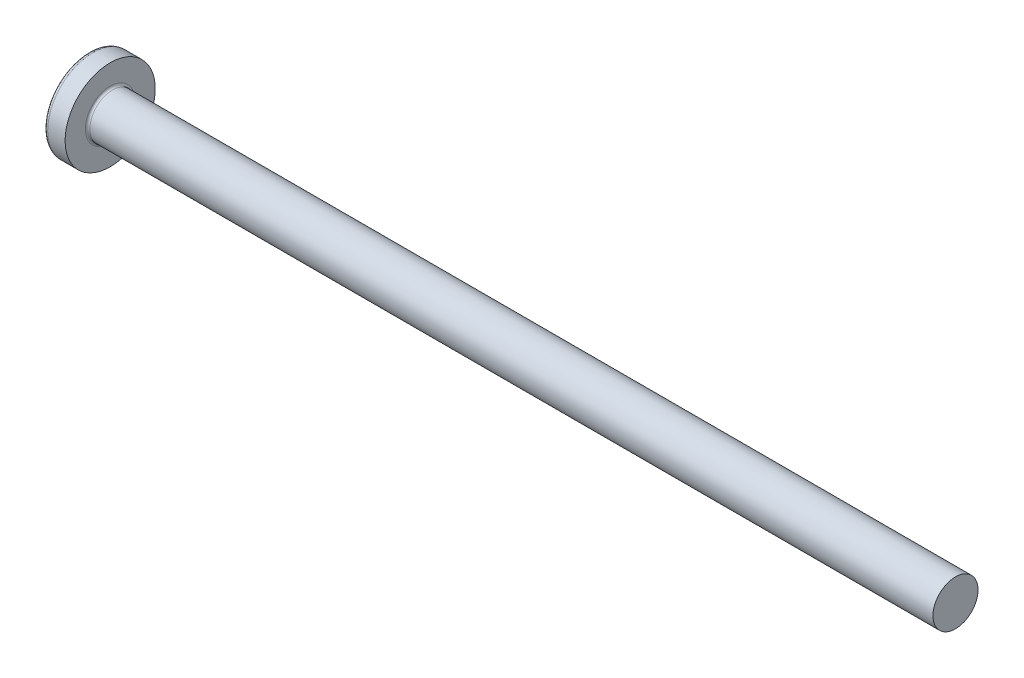
ISO-10303-21;
HEADER;
FILE_DESCRIPTION(('STEP AP214'),'2;1');
FILE_NAME('part.step','',(''),(''),'','','');
FILE_SCHEMA(('AUTOMOTIVE_DESIGN { 1 0 10303 214 1 1 1 1 }'));
ENDSEC;
DATA;
#1=APPLICATION_CONTEXT('core data for automotive mechanical design processes');
#2=APPLICATION_PROTOCOL_DEFINITION('international standard','automotive_design',2000,#1);
#3=PRODUCT_CONTEXT('',#1,'mechanical');
#4=PRODUCT('Part','Part','',(#3));
#5=PRODUCT_RELATED_PRODUCT_CATEGORY('part','',(#4));
#6=PRODUCT_DEFINITION_FORMATION('','',#4);
#7=PRODUCT_DEFINITION_CONTEXT('part definition',#1,'design');
#8=PRODUCT_DEFINITION('design','',#6,#7);
#9=PRODUCT_DEFINITION_SHAPE('','',#8);
#10=(LENGTH_UNIT() NAMED_UNIT(*) SI_UNIT(.MILLI.,.METRE.));
#11=(NAMED_UNIT(*) PLANE_ANGLE_UNIT() SI_UNIT($,.RADIAN.));
#12=(NAMED_UNIT(*) SI_UNIT($,.STERADIAN.) SOLID_ANGLE_UNIT());
#13=UNCERTAINTY_MEASURE_WITH_UNIT(LENGTH_MEASURE(1.E-05),#10,'distance_accuracy_value','');
#14=(GEOMETRIC_REPRESENTATION_CONTEXT(3) GLOBAL_UNCERTAINTY_ASSIGNED_CONTEXT((#13)) GLOBAL_UNIT_ASSIGNED_CONTEXT((#10,
#11,#12)) REPRESENTATION_CONTEXT('',''));
#15=CARTESIAN_POINT('',(0.,0.,0.));
#16=DIRECTION('',(0.,0.,1.));
#17=DIRECTION('',(1.,0.,0.));
#18=AXIS2_PLACEMENT_3D('',#15,#16,#17);
#19=CARTESIAN_POINT('',(6.5,0.,0.));
#20=DIRECTION('',(-1.,0.,0.));
#21=DIRECTION('',(0.,1.,0.));
#22=AXIS2_PLACEMENT_3D('',#19,#20,#21);
#23=SPHERICAL_SURFACE('',#22,6.5);
#24=CARTESIAN_POINT('',(1.26538895452803,0.,0.));
#25=DIRECTION('',(-1.,0.,0.));
#26=DIRECTION('',(0.,0.,1.));
#27=AXIS2_PLACEMENT_3D('',#24,#25,#26);
#28=CIRCLE('',#27,3.85342019543974);
#29=CARTESIAN_POINT('',(1.26538895452803,0.,3.85342019543974));
#30=VERTEX_POINT('',#29);
#31=EDGE_CURVE('E222',#30,#30,#28,.T.);
#32=ORIENTED_EDGE('',*,*,#31,.T.);
#33=EDGE_LOOP('',(#32));
#34=FACE_BOUND('',#33,.T.);
#35=CARTESIAN_POINT('',(0.0788099820016241,0.,0.));
#36=DIRECTION('',(1.,0.,0.));
#37=DIRECTION('',(0.,0.,-1.));
#38=AXIS2_PLACEMENT_3D('',#35,#36,#37);
#39=CIRCLE('',#38,1.0091178091571);
#40=CARTESIAN_POINT('',(0.0788099820016233,-0.514999999999997,-0.867809744562728));
#41=VERTEX_POINT('',#40);
#42=CARTESIAN_POINT('',(0.0788099820016245,-0.867809744562729,-0.515));
#43=VERTEX_POINT('',#42);
#44=EDGE_CURVE('E381',#41,#43,#39,.F.);
#45=ORIENTED_EDGE('',*,*,#44,.F.);
#46=CARTESIAN_POINT('',(6.5,-0.515,0.));
#47=DIRECTION('',(0.,1.,0.));
#48=DIRECTION('',(0.,0.,1.));
#49=AXIS2_PLACEMENT_3D('',#46,#47,#48);
#50=CIRCLE('',#49,6.47956595768575);
#51=CARTESIAN_POINT('',(0.331830520157853,-0.514999999999993,-1.98455543332603));
#52=VERTEX_POINT('',#51);
#53=EDGE_CURVE('E297',#52,#41,#50,.T.);
#54=ORIENTED_EDGE('',*,*,#53,.F.);
#55=CARTESIAN_POINT('',(6.06443225879603,0.,0.873613881878153));
#56=DIRECTION('',(0.446197753347436,0.,-0.894934391398443));
#57=DIRECTION('',(-0.894934391398442,0.,-0.446197753347436));
#58=AXIS2_PLACEMENT_3D('',#55,#56,#57);
#59=CIRCLE('',#58,6.42628038045433);
#60=CARTESIAN_POINT('',(0.331830520157853,0.515000000000007,-1.98455543332603));
#61=VERTEX_POINT('',#60);
#62=EDGE_CURVE('E266',#52,#61,#59,.T.);
#63=ORIENTED_EDGE('',*,*,#62,.T.);
#64=CARTESIAN_POINT('',(6.5,0.515,0.));
#65=DIRECTION('',(0.,-1.,0.));
#66=DIRECTION('',(0.,0.,-1.));
#67=AXIS2_PLACEMENT_3D('',#64,#65,#66);
#68=CIRCLE('',#67,6.47956595768575);
#69=CARTESIAN_POINT('',(0.0788099820016234,0.515000000000003,-0.867809744562724));
#70=VERTEX_POINT('',#69);
#71=EDGE_CURVE('E333',#70,#61,#68,.T.);
#72=ORIENTED_EDGE('',*,*,#71,.F.);
#73=CARTESIAN_POINT('',(0.0788099820016245,0.86780974456273,-0.515));
#74=VERTEX_POINT('',#73);
#75=EDGE_CURVE('E402',#74,#70,#39,.F.);
#76=ORIENTED_EDGE('',*,*,#75,.F.);
#77=CARTESIAN_POINT('',(6.5,0.,-0.515));
#78=DIRECTION('',(0.,0.,1.));
#79=DIRECTION('',(1.,0.,0.));
#80=AXIS2_PLACEMENT_3D('',#77,#78,#79);
#81=CIRCLE('',#80,6.47956595768575);
#82=CARTESIAN_POINT('',(0.331830520157854,1.98455543332603,-0.515));
#83=VERTEX_POINT('',#82);
#84=EDGE_CURVE('E258',#83,#74,#81,.T.);
#85=ORIENTED_EDGE('',*,*,#84,.F.);
#86=CARTESIAN_POINT('',(6.06443225879603,-0.873613881878153,0.));
#87=DIRECTION('',(0.446197753347436,0.894934391398443,0.));
#88=DIRECTION('',(-0.894934391398442,0.446197753347436,0.));
#89=AXIS2_PLACEMENT_3D('',#86,#87,#88);
#90=CIRCLE('',#89,6.42628038045433);
#91=CARTESIAN_POINT('',(0.331830520157854,1.98455543332603,0.515));
#92=VERTEX_POINT('',#91);
#93=EDGE_CURVE('E262',#83,#92,#90,.T.);
#94=ORIENTED_EDGE('',*,*,#93,.T.);
#95=CARTESIAN_POINT('',(6.5,0.,0.515));
#96=DIRECTION('',(0.,0.,-1.));
#97=DIRECTION('',(0.,1.,0.));
#98=AXIS2_PLACEMENT_3D('',#95,#96,#97);
#99=CIRCLE('',#98,6.47956595768575);
#100=CARTESIAN_POINT('',(0.0788099820016245,0.86780974456273,0.515));
#101=VERTEX_POINT('',#100);
#102=EDGE_CURVE('E253',#101,#92,#99,.T.);
#103=ORIENTED_EDGE('',*,*,#102,.F.);
#104=CARTESIAN_POINT('',(0.0788099820016232,0.514999999999997,0.867809744562728));
#105=VERTEX_POINT('',#104);
#106=EDGE_CURVE('E401',#105,#101,#39,.F.);
#107=ORIENTED_EDGE('',*,*,#106,.F.);
#108=CARTESIAN_POINT('',(0.331830520157854,0.514999999999993,1.98455543332604));
#109=VERTEX_POINT('',#108);
#110=EDGE_CURVE('E278',#109,#105,#68,.T.);
#111=ORIENTED_EDGE('',*,*,#110,.F.);
#112=CARTESIAN_POINT('',(6.06443225879603,0.,-0.873613881878153));
#113=DIRECTION('',(0.446197753347436,0.,0.894934391398443));
#114=DIRECTION('',(0.894934391398442,0.,-0.446197753347436));
#115=AXIS2_PLACEMENT_3D('',#112,#113,#114);
#116=CIRCLE('',#115,6.42628038045433);
#117=CARTESIAN_POINT('',(0.331830520157854,-0.515000000000007,1.98455543332603));
#118=VERTEX_POINT('',#117);
#119=EDGE_CURVE('E56',#109,#118,#116,.T.);
#120=ORIENTED_EDGE('',*,*,#119,.T.);
#121=CARTESIAN_POINT('',(0.0788099820016234,-0.515000000000003,0.867809744562724));
#122=VERTEX_POINT('',#121);
#123=EDGE_CURVE('E275',#122,#118,#50,.T.);
#124=ORIENTED_EDGE('',*,*,#123,.F.);
#125=CARTESIAN_POINT('',(0.0788099820016245,-0.867809744562729,0.515));
#126=VERTEX_POINT('',#125);
#127=EDGE_CURVE('E440',#126,#122,#39,.F.);
#128=ORIENTED_EDGE('',*,*,#127,.F.);
#129=CARTESIAN_POINT('',(0.331830520157854,-1.98455543332603,0.515));
#130=VERTEX_POINT('',#129);
#131=EDGE_CURVE('E254',#130,#126,#99,.T.);
#132=ORIENTED_EDGE('',*,*,#131,.F.);
#133=CARTESIAN_POINT('',(6.06443225879604,0.873613881878153,0.));
#134=DIRECTION('',(0.446197753347436,-0.894934391398443,0.));
#135=DIRECTION('',(0.894934391398442,0.446197753347436,0.));
#136=AXIS2_PLACEMENT_3D('',#133,#134,#135);
#137=CIRCLE('',#136,6.42628038045433);
#138=CARTESIAN_POINT('',(0.331830520157854,-1.98455543332603,-0.515));
#139=VERTEX_POINT('',#138);
#140=EDGE_CURVE('E249',#130,#139,#137,.T.);
#141=ORIENTED_EDGE('',*,*,#140,.T.);
#142=EDGE_CURVE('E71',#43,#139,#81,.T.);
#143=ORIENTED_EDGE('',*,*,#142,.F.);
#144=EDGE_LOOP('',(#45,#54,#63,#72,#76,#85,#94,#103,#107,#111,#120,#124,#128,#132,#141,#143));
#145=FACE_BOUND('',#144,.T.);
#146=ADVANCED_FACE('F41',(#34,#145),#23,.T.);
#147=CARTESIAN_POINT('',(0.,2.15,-0.515));
#148=DIRECTION('',(0.,0.,1.));
#149=DIRECTION('',(1.,0.,0.));
#150=AXIS2_PLACEMENT_3D('',#147,#148,#149);
#151=PLANE('',#150);
#152=ORIENTED_EDGE('',*,*,#84,.T.);
#153=CARTESIAN_POINT('',(-1.51195208675156,0.994972220320188,-0.515));
#154=CARTESIAN_POINT('',(-1.2040598194928,0.970722016949958,-0.515));
#155=CARTESIAN_POINT('',(-0.896180907521175,0.946299109919651,-0.515));
#156=CARTESIAN_POINT('',(-0.280449079832186,0.896981122427851,-0.515));
#157=CARTESIAN_POINT('',(0.0274038344396859,0.872086023934883,-0.515));
#158=CARTESIAN_POINT('',(0.48914673951535,0.83429553519528,-0.515));
#159=CARTESIAN_POINT('',(0.643055047553845,0.821624058404092,-0.515));
#160=CARTESIAN_POINT('',(0.950856520197139,0.796108332639504,-0.515));
#161=CARTESIAN_POINT('',(1.10474968487868,0.783264084592466,-0.515));
#162=CARTESIAN_POINT('',(1.41251352095103,0.757376569093378,-0.515));
#163=CARTESIAN_POINT('',(1.56638419296577,0.744333309065218,-0.515));
#164=CARTESIAN_POINT('',(1.87410847343335,0.718013273188896,-0.515));
#165=CARTESIAN_POINT('',(2.02796208151372,0.704736492982792,-0.515));
#166=CARTESIAN_POINT('',(2.36455311890989,0.675386943006726,-0.515));
#167=CARTESIAN_POINT('',(2.54728562293342,0.659257575640986,-0.515));
#168=CARTESIAN_POINT('',(2.91270624109256,0.626517182479888,-0.515));
#169=CARTESIAN_POINT('',(3.09539435554038,0.609906160177238,-0.515));
#170=CARTESIAN_POINT('',(3.46069832191613,0.576073027116421,-0.515));
#171=CARTESIAN_POINT('',(3.64331417870068,0.558850968932727,-0.515));
#172=CARTESIAN_POINT('',(4.00847437496567,0.523604864540037,-0.515));
#173=CARTESIAN_POINT('',(4.19101871216888,0.505580794604253,-0.515));
#174=CARTESIAN_POINT('',(4.55606208157937,0.468429191666488,-0.515));
#175=CARTESIAN_POINT('',(4.73856107358023,0.449301262281853,-0.515));
#176=CARTESIAN_POINT('',(5.10337547353419,0.409473604748924,-0.515));
#177=CARTESIAN_POINT('',(5.28569089526422,0.388774005106069,-0.515));
#178=CARTESIAN_POINT('',(5.55897278495412,0.355828287527264,-0.515));
#179=CARTESIAN_POINT('',(5.65005277419686,0.344527918782738,-0.515));
#180=CARTESIAN_POINT('',(5.83209904103608,0.321075174263031,-0.515));
#181=CARTESIAN_POINT('',(5.92306532397915,0.308922840209686,-0.515));
#182=CARTESIAN_POINT('',(6.10486078872898,0.28342733445193,-0.515));
#183=CARTESIAN_POINT('',(6.1956899229938,0.270083817601714,-0.515));
#184=CARTESIAN_POINT('',(6.33172773785679,0.248701420809951,-0.515));
#185=CARTESIAN_POINT('',(6.37704304473344,0.241345446705304,-0.515));
#186=CARTESIAN_POINT('',(6.4675722520141,0.226018953559338,-0.515));
#187=CARTESIAN_POINT('',(6.51278614568083,0.218048394864476,-0.515));
#188=CARTESIAN_POINT('',(6.55793125759549,0.209691465274944,-0.515));
#189=B_SPLINE_CURVE_WITH_KNOTS('',3,(#153,#154,#155,#156,#157,#158,#159,#160,#161,#162,#163,
#164,#165,#166,#167,#168,#169,#170,#171,#172,#173,#174,#175,#176,#177,#178,#179,#180,#181,#182,
#183,#184,#185,#186,#187,#188),.UNSPECIFIED.,.F.,.F.,(4,2,2,2,2,2,2,2,2,2,2,2,2,2,2,2,2,4),(0.,
0.926537709781721,1.85311087258339,2.31639796016285,2.77968256468771,3.24294992902055,
3.70622594801777,4.25655436065378,4.80687878359543,5.35715597005738,5.90744944680718,
6.45794177197673,7.008389135274,7.28372117336899,7.55903973750591,7.83443833587749,
7.97216007460855,8.10989070671571),.UNSPECIFIED.);
#190=CARTESIAN_POINT('',(2.34,0.677477674908923,-0.515));
#191=VERTEX_POINT('',#190);
#192=EDGE_CURVE('E425',#74,#191,#189,.T.);
#193=ORIENTED_EDGE('',*,*,#192,.T.);
#194=DIRECTION('',(0.,1.,0.));
#195=VECTOR('',#194,1.);
#196=CARTESIAN_POINT('',(2.34,-0.983319232260742,-0.515));
#197=LINE('',#196,#195);
#198=CARTESIAN_POINT('',(2.34,0.983319232260743,-0.515));
#199=VERTEX_POINT('',#198);
#200=EDGE_CURVE('E362',#191,#199,#197,.T.);
#201=ORIENTED_EDGE('',*,*,#200,.T.);
#202=DIRECTION('',(0.894934391398442,-0.446197753347436,0.));
#203=VECTOR('',#202,1.);
#204=CARTESIAN_POINT('',(0.,2.15,-0.515));
#205=LINE('',#204,#203);
#206=EDGE_CURVE('E223',#83,#199,#205,.T.);
#207=ORIENTED_EDGE('',*,*,#206,.F.);
#208=EDGE_LOOP('',(#152,#193,#201,#207));
#209=FACE_BOUND('',#208,.T.);
#210=ADVANCED_FACE('F177',(#209),#151,.T.);
#211=CARTESIAN_POINT('',(2.34,-0.983319232260742,-0.515));
#212=VERTEX_POINT('',#211);
#213=CARTESIAN_POINT('',(2.34,-0.677477674908923,-0.515));
#214=VERTEX_POINT('',#213);
#215=EDGE_CURVE('E233',#212,#214,#197,.T.);
#216=ORIENTED_EDGE('',*,*,#215,.T.);
#217=CARTESIAN_POINT('',(-1.51195208675156,-0.994972220320188,-0.515));
#218=CARTESIAN_POINT('',(-1.2040598194928,-0.970722016949958,-0.515));
#219=CARTESIAN_POINT('',(-0.896180907521175,-0.946299109919651,-0.515));
#220=CARTESIAN_POINT('',(-0.280449079832186,-0.896981122427851,-0.515));
#221=CARTESIAN_POINT('',(0.0274038344396859,-0.872086023934883,-0.515));
#222=CARTESIAN_POINT('',(0.489146739515349,-0.83429553519528,-0.515));
#223=CARTESIAN_POINT('',(0.643055047553845,-0.821624058404092,-0.515));
#224=CARTESIAN_POINT('',(0.950856520197139,-0.796108332639504,-0.515));
#225=CARTESIAN_POINT('',(1.10474968487868,-0.783264084592466,-0.515));
#226=CARTESIAN_POINT('',(1.41251352095103,-0.757376569093378,-0.515));
#227=CARTESIAN_POINT('',(1.56638419296577,-0.744333309065218,-0.515));
#228=CARTESIAN_POINT('',(1.87410847343335,-0.718013273188896,-0.515));
#229=CARTESIAN_POINT('',(2.02796208151372,-0.704736492982792,-0.515));
#230=CARTESIAN_POINT('',(2.36455311890989,-0.675386943006726,-0.515));
#231=CARTESIAN_POINT('',(2.54728562293342,-0.659257575640986,-0.515));
#232=CARTESIAN_POINT('',(2.91270624109256,-0.626517182479888,-0.515));
#233=CARTESIAN_POINT('',(3.09539435554038,-0.609906160177238,-0.515));
#234=CARTESIAN_POINT('',(3.46069832191613,-0.576073027116421,-0.515));
#235=CARTESIAN_POINT('',(3.64331417870068,-0.558850968932727,-0.515));
#236=CARTESIAN_POINT('',(4.00847437496567,-0.523604864540037,-0.515));
#237=CARTESIAN_POINT('',(4.19101871216888,-0.505580794604253,-0.515));
#238=CARTESIAN_POINT('',(4.55606208157937,-0.468429191666488,-0.515));
#239=CARTESIAN_POINT('',(4.73856107358023,-0.449301262281853,-0.515));
#240=CARTESIAN_POINT('',(5.10337547353419,-0.409473604748924,-0.515));
#241=CARTESIAN_POINT('',(5.28569089526422,-0.388774005106069,-0.515));
#242=CARTESIAN_POINT('',(5.55897278495412,-0.355828287527264,-0.515));
#243=CARTESIAN_POINT('',(5.65005277419686,-0.344527918782738,-0.515));
#244=CARTESIAN_POINT('',(5.83209904103608,-0.321075174263031,-0.515));
#245=CARTESIAN_POINT('',(5.92306532397915,-0.308922840209686,-0.515));
#246=CARTESIAN_POINT('',(6.10486078872898,-0.28342733445193,-0.515));
#247=CARTESIAN_POINT('',(6.1956899229938,-0.270083817601714,-0.515));
#248=CARTESIAN_POINT('',(6.3317277378568,-0.24870142080995,-0.515));
#249=CARTESIAN_POINT('',(6.37704304473344,-0.241345446705304,-0.515));
#250=CARTESIAN_POINT('',(6.4675722520141,-0.226018953559337,-0.515));
#251=CARTESIAN_POINT('',(6.51278614568083,-0.218048394864476,-0.515));
#252=CARTESIAN_POINT('',(6.55793125759549,-0.209691465274944,-0.515));
#253=B_SPLINE_CURVE_WITH_KNOTS('',3,(#217,#218,#219,#220,#221,#222,#223,#224,#225,#226,#227,
#228,#229,#230,#231,#232,#233,#234,#235,#236,#237,#238,#239,#240,#241,#242,#243,#244,#245,#246,
#247,#248,#249,#250,#251,#252),.UNSPECIFIED.,.F.,.F.,(4,2,2,2,2,2,2,2,2,2,2,2,2,2,2,2,2,4),(0.,
0.926537709781721,1.85311087258339,2.31639796016285,2.77968256468771,3.24294992902055,
3.70622594801777,4.25655436065378,4.80687878359543,5.35715597005738,5.90744944680718,
6.45794177197674,7.008389135274,7.28372117336899,7.55903973750591,7.83443833587749,
7.97216007460855,8.10989070671572),.UNSPECIFIED.);
#254=EDGE_CURVE('E400',#214,#43,#253,.F.);
#255=ORIENTED_EDGE('',*,*,#254,.T.);
#256=ORIENTED_EDGE('',*,*,#142,.T.);
#257=DIRECTION('',(0.894934391398442,0.446197753347436,0.));
#258=VECTOR('',#257,1.);
#259=CARTESIAN_POINT('',(0.,-2.15,-0.515));
#260=LINE('',#259,#258);
#261=EDGE_CURVE('E337',#139,#212,#260,.T.);
#262=ORIENTED_EDGE('',*,*,#261,.T.);
#263=EDGE_LOOP('',(#216,#255,#256,#262));
#264=FACE_BOUND('',#263,.T.);
#265=ADVANCED_FACE('F183',(#264),#151,.T.);
#266=CARTESIAN_POINT('',(0.,-2.15,0.515));
#267=DIRECTION('',(0.,0.,-1.));
#268=DIRECTION('',(0.,1.,0.));
#269=AXIS2_PLACEMENT_3D('',#266,#267,#268);
#270=PLANE('',#269);
#271=DIRECTION('',(0.,-1.,0.));
#272=VECTOR('',#271,1.);
#273=CARTESIAN_POINT('',(2.34,0.983319232260742,0.515));
#274=LINE('',#273,#272);
#275=CARTESIAN_POINT('',(2.34,0.983319232260743,0.515));
#276=VERTEX_POINT('',#275);
#277=CARTESIAN_POINT('',(2.34,0.677477674908923,0.515));
#278=VERTEX_POINT('',#277);
#279=EDGE_CURVE('E348',#276,#278,#274,.T.);
#280=ORIENTED_EDGE('',*,*,#279,.T.);
#281=CARTESIAN_POINT('',(-1.51195208675156,0.994972220320187,0.515));
#282=CARTESIAN_POINT('',(-1.2040598194928,0.970722016949958,0.515));
#283=CARTESIAN_POINT('',(-0.896180907521175,0.946299109919651,0.515));
#284=CARTESIAN_POINT('',(-0.280449079832187,0.896981122427851,0.515));
#285=CARTESIAN_POINT('',(0.0274038344396859,0.872086023934883,0.515));
#286=CARTESIAN_POINT('',(0.489146739515349,0.83429553519528,0.515));
#287=CARTESIAN_POINT('',(0.643055047553845,0.821624058404092,0.515));
#288=CARTESIAN_POINT('',(0.950856520197139,0.796108332639504,0.515));
#289=CARTESIAN_POINT('',(1.10474968487868,0.783264084592466,0.515));
#290=CARTESIAN_POINT('',(1.41251352095103,0.757376569093378,0.515));
#291=CARTESIAN_POINT('',(1.56638419296577,0.744333309065218,0.515));
#292=CARTESIAN_POINT('',(1.87410847343335,0.718013273188896,0.515));
#293=CARTESIAN_POINT('',(2.02796208151372,0.704736492982792,0.515));
#294=CARTESIAN_POINT('',(2.36455311890989,0.675386943006726,0.515));
#295=CARTESIAN_POINT('',(2.54728562293342,0.659257575640986,0.515));
#296=CARTESIAN_POINT('',(2.91270624109256,0.626517182479888,0.515));
#297=CARTESIAN_POINT('',(3.09539435554038,0.609906160177238,0.515));
#298=CARTESIAN_POINT('',(3.46069832191612,0.576073027116421,0.515));
#299=CARTESIAN_POINT('',(3.64331417870068,0.558850968932727,0.515));
#300=CARTESIAN_POINT('',(4.00847437496567,0.523604864540037,0.515));
#301=CARTESIAN_POINT('',(4.19101871216888,0.505580794604253,0.515));
#302=CARTESIAN_POINT('',(4.55606208157937,0.468429191666488,0.515));
#303=CARTESIAN_POINT('',(4.73856107358022,0.449301262281854,0.515));
#304=CARTESIAN_POINT('',(5.10337547353418,0.409473604748925,0.515));
#305=CARTESIAN_POINT('',(5.28569089526422,0.38877400510607,0.515));
#306=CARTESIAN_POINT('',(5.55897278495412,0.355828287527264,0.515));
#307=CARTESIAN_POINT('',(5.65005277419686,0.344527918782739,0.515));
#308=CARTESIAN_POINT('',(5.83209904103607,0.321075174263031,0.515));
#309=CARTESIAN_POINT('',(5.92306532397915,0.308922840209686,0.515));
#310=CARTESIAN_POINT('',(6.10486078872898,0.28342733445193,0.515));
#311=CARTESIAN_POINT('',(6.1956899229938,0.270083817601714,0.515));
#312=CARTESIAN_POINT('',(6.33172773785679,0.248701420809951,0.515));
#313=CARTESIAN_POINT('',(6.37704304473344,0.241345446705304,0.515));
#314=CARTESIAN_POINT('',(6.4675722520141,0.226018953559338,0.515));
#315=CARTESIAN_POINT('',(6.51278614568083,0.218048394864476,0.515));
#316=CARTESIAN_POINT('',(6.55793125759549,0.209691465274945,0.515));
#317=B_SPLINE_CURVE_WITH_KNOTS('',3,(#281,#282,#283,#284,#285,#286,#287,#288,#289,#290,#291,
#292,#293,#294,#295,#296,#297,#298,#299,#300,#301,#302,#303,#304,#305,#306,#307,#308,#309,#310,
#311,#312,#313,#314,#315,#316),.UNSPECIFIED.,.F.,.F.,(4,2,2,2,2,2,2,2,2,2,2,2,2,2,2,2,2,4),(0.,
0.926537709781721,1.85311087258339,2.31639796016285,2.77968256468771,3.24294992902055,
3.70622594801777,4.25655436065378,4.80687878359543,5.35715597005738,5.90744944680718,
6.45794177197673,7.008389135274,7.28372117336899,7.55903973750591,7.83443833587749,
7.97216007460855,8.10989070671571),.UNSPECIFIED.);
#318=EDGE_CURVE('E302',#278,#101,#317,.F.);
#319=ORIENTED_EDGE('',*,*,#318,.T.);
#320=ORIENTED_EDGE('',*,*,#102,.T.);
#321=DIRECTION('',(0.894934391398442,-0.446197753347436,0.));
#322=VECTOR('',#321,1.);
#323=CARTESIAN_POINT('',(0.,2.15,0.515));
#324=LINE('',#323,#322);
#325=EDGE_CURVE('E230',#92,#276,#324,.T.);
#326=ORIENTED_EDGE('',*,*,#325,.T.);
#327=EDGE_LOOP('',(#280,#319,#320,#326));
#328=FACE_BOUND('',#327,.T.);
#329=ADVANCED_FACE('F421',(#328),#270,.T.);
#330=ORIENTED_EDGE('',*,*,#131,.T.);
#331=CARTESIAN_POINT('',(-1.51195208675156,-0.994972220320188,0.515));
#332=CARTESIAN_POINT('',(-1.2040598194928,-0.970722016949958,0.515));
#333=CARTESIAN_POINT('',(-0.896180907521175,-0.946299109919651,0.515));
#334=CARTESIAN_POINT('',(-0.280449079832186,-0.896981122427852,0.515));
#335=CARTESIAN_POINT('',(0.0274038344396859,-0.872086023934883,0.515));
#336=CARTESIAN_POINT('',(0.48914673951535,-0.83429553519528,0.515));
#337=CARTESIAN_POINT('',(0.643055047553845,-0.821624058404092,0.515));
#338=CARTESIAN_POINT('',(0.950856520197139,-0.796108332639504,0.515));
#339=CARTESIAN_POINT('',(1.10474968487868,-0.783264084592466,0.515));
#340=CARTESIAN_POINT('',(1.41251352095103,-0.757376569093379,0.515));
#341=CARTESIAN_POINT('',(1.56638419296577,-0.744333309065218,0.515));
#342=CARTESIAN_POINT('',(1.87410847343335,-0.718013273188896,0.515));
#343=CARTESIAN_POINT('',(2.02796208151372,-0.704736492982792,0.515));
#344=CARTESIAN_POINT('',(2.36455311890989,-0.675386943006726,0.515));
#345=CARTESIAN_POINT('',(2.54728562293342,-0.659257575640986,0.515));
#346=CARTESIAN_POINT('',(2.91270624109256,-0.626517182479888,0.515));
#347=CARTESIAN_POINT('',(3.09539435554038,-0.609906160177238,0.515));
#348=CARTESIAN_POINT('',(3.46069832191613,-0.576073027116422,0.515));
#349=CARTESIAN_POINT('',(3.64331417870068,-0.558850968932728,0.515));
#350=CARTESIAN_POINT('',(4.00847437496567,-0.523604864540037,0.515));
#351=CARTESIAN_POINT('',(4.19101871216888,-0.505580794604253,0.515));
#352=CARTESIAN_POINT('',(4.55606208157937,-0.468429191666488,0.515));
#353=CARTESIAN_POINT('',(4.73856107358023,-0.449301262281854,0.515));
#354=CARTESIAN_POINT('',(5.10337547353419,-0.409473604748924,0.515));
#355=CARTESIAN_POINT('',(5.28569089526422,-0.38877400510607,0.515));
#356=CARTESIAN_POINT('',(5.55897278495412,-0.355828287527264,0.515));
#357=CARTESIAN_POINT('',(5.65005277419686,-0.344527918782739,0.515));
#358=CARTESIAN_POINT('',(5.83209904103608,-0.321075174263031,0.515));
#359=CARTESIAN_POINT('',(5.92306532397915,-0.308922840209686,0.515));
#360=CARTESIAN_POINT('',(6.10486078872898,-0.28342733445193,0.515));
#361=CARTESIAN_POINT('',(6.1956899229938,-0.270083817601714,0.515));
#362=CARTESIAN_POINT('',(6.33172773785679,-0.248701420809951,0.515));
#363=CARTESIAN_POINT('',(6.37704304473344,-0.241345446705304,0.515));
#364=CARTESIAN_POINT('',(6.4675722520141,-0.226018953559338,0.515));
#365=CARTESIAN_POINT('',(6.51278614568083,-0.218048394864477,0.515));
#366=CARTESIAN_POINT('',(6.55793125759549,-0.209691465274945,0.515));
#367=B_SPLINE_CURVE_WITH_KNOTS('',3,(#331,#332,#333,#334,#335,#336,#337,#338,#339,#340,#341,
#342,#343,#344,#345,#346,#347,#348,#349,#350,#351,#352,#353,#354,#355,#356,#357,#358,#359,#360,
#361,#362,#363,#364,#365,#366),.UNSPECIFIED.,.F.,.F.,(4,2,2,2,2,2,2,2,2,2,2,2,2,2,2,2,2,4),(0.,
0.926537709781721,1.85311087258339,2.31639796016285,2.77968256468771,3.24294992902055,
3.70622594801777,4.25655436065378,4.80687878359543,5.35715597005738,5.90744944680718,
6.45794177197673,7.008389135274,7.28372117336899,7.55903973750591,7.83443833587749,
7.97216007460855,8.10989070671571),.UNSPECIFIED.);
#368=CARTESIAN_POINT('',(2.34,-0.677477674908923,0.515));
#369=VERTEX_POINT('',#368);
#370=EDGE_CURVE('E441',#126,#369,#367,.T.);
#371=ORIENTED_EDGE('',*,*,#370,.T.);
#372=CARTESIAN_POINT('',(2.34,-0.983319232260742,0.515));
#373=VERTEX_POINT('',#372);
#374=EDGE_CURVE('E351',#369,#373,#274,.T.);
#375=ORIENTED_EDGE('',*,*,#374,.T.);
#376=DIRECTION('',(0.894934391398442,0.446197753347436,0.));
#377=VECTOR('',#376,1.);
#378=CARTESIAN_POINT('',(0.,-2.15,0.515));
#379=LINE('',#378,#377);
#380=EDGE_CURVE('E340',#130,#373,#379,.T.);
#381=ORIENTED_EDGE('',*,*,#380,.F.);
#382=EDGE_LOOP('',(#330,#371,#375,#381));
#383=FACE_BOUND('',#382,.T.);
#384=ADVANCED_FACE('F471',(#383),#270,.T.);
#385=CARTESIAN_POINT('',(2.34,0.983319232260742,-0.515));
#386=DIRECTION('',(-1.,0.,0.));
#387=DIRECTION('',(0.,0.,1.));
#388=AXIS2_PLACEMENT_3D('',#385,#386,#387);
#389=PLANE('',#388);
#390=ORIENTED_EDGE('',*,*,#374,.F.);
#391=CARTESIAN_POINT('',(2.34,0.,0.));
#392=DIRECTION('',(-1.,0.,0.));
#393=DIRECTION('',(0.,0.,1.));
#394=AXIS2_PLACEMENT_3D('',#391,#392,#393);
#395=CIRCLE('',#394,0.851);
#396=EDGE_CURVE('E393',#214,#369,#395,.T.);
#397=ORIENTED_EDGE('',*,*,#396,.F.);
#398=ORIENTED_EDGE('',*,*,#215,.F.);
#399=DIRECTION('',(0.,0.,1.));
#400=VECTOR('',#399,1.);
#401=CARTESIAN_POINT('',(2.34,-0.983319232260742,-0.515));
#402=LINE('',#401,#400);
#403=EDGE_CURVE('E344',#212,#373,#402,.T.);
#404=ORIENTED_EDGE('',*,*,#403,.T.);
#405=EDGE_LOOP('',(#390,#397,#398,#404));
#406=FACE_BOUND('',#405,.T.);
#407=ADVANCED_FACE('F464',(#406),#389,.T.);
#408=DIRECTION('',(0.,0.,-1.));
#409=VECTOR('',#408,1.);
#410=CARTESIAN_POINT('',(2.34,-0.515000000000004,0.983319232260741));
#411=LINE('',#410,#409);
#412=CARTESIAN_POINT('',(2.34,-0.514999999999998,-0.677477674908925));
#413=VERTEX_POINT('',#412);
#414=CARTESIAN_POINT('',(2.34,-0.514999999999996,-0.983319232260744));
#415=VERTEX_POINT('',#414);
#416=EDGE_CURVE('E324',#413,#415,#411,.T.);
#417=ORIENTED_EDGE('',*,*,#416,.F.);
#418=CARTESIAN_POINT('',(2.34,0.515000000000002,-0.677477674908921));
#419=VERTEX_POINT('',#418);
#420=EDGE_CURVE('E63',#419,#413,#395,.T.);
#421=ORIENTED_EDGE('',*,*,#420,.F.);
#422=DIRECTION('',(0.,0.,1.));
#423=VECTOR('',#422,1.);
#424=CARTESIAN_POINT('',(2.34,0.515000000000004,-0.983319232260741));
#425=LINE('',#424,#423);
#426=CARTESIAN_POINT('',(2.34,0.515000000000004,-0.983319232260741));
#427=VERTEX_POINT('',#426);
#428=EDGE_CURVE('E328',#427,#419,#425,.T.);
#429=ORIENTED_EDGE('',*,*,#428,.F.);
#430=DIRECTION('',(0.,-1.,0.));
#431=VECTOR('',#430,1.);
#432=CARTESIAN_POINT('',(2.34,0.515000000000004,-0.983319232260741));
#433=LINE('',#432,#431);
#434=EDGE_CURVE('E316',#427,#415,#433,.T.);
#435=ORIENTED_EDGE('',*,*,#434,.T.);
#436=EDGE_LOOP('',(#417,#421,#429,#435));
#437=FACE_BOUND('',#436,.T.);
#438=ADVANCED_FACE('F385',(#437),#389,.T.);
#439=ORIENTED_EDGE('',*,*,#200,.F.);
#440=EDGE_CURVE('E392',#278,#191,#395,.T.);
#441=ORIENTED_EDGE('',*,*,#440,.F.);
#442=ORIENTED_EDGE('',*,*,#279,.F.);
#443=DIRECTION('',(0.,0.,-1.));
#444=VECTOR('',#443,1.);
#445=CARTESIAN_POINT('',(2.34,0.983319232260742,0.515));
#446=LINE('',#445,#444);
#447=EDGE_CURVE('E352',#276,#199,#446,.T.);
#448=ORIENTED_EDGE('',*,*,#447,.T.);
#449=EDGE_LOOP('',(#439,#441,#442,#448));
#450=FACE_BOUND('',#449,.T.);
#451=ADVANCED_FACE('F465',(#450),#389,.T.);
#452=CARTESIAN_POINT('',(0.,0.514999999999993,2.15));
#453=DIRECTION('',(0.,-1.,0.));
#454=DIRECTION('',(1.,0.,0.));
#455=AXIS2_PLACEMENT_3D('',#452,#453,#454);
#456=PLANE('',#455);
#457=ORIENTED_EDGE('',*,*,#110,.T.);
#458=CARTESIAN_POINT('',(-1.51195208754038,0.514999999999997,0.994972220382299));
#459=CARTESIAN_POINT('',(-1.20405982018868,0.514999999999997,0.970722017005066));
#460=CARTESIAN_POINT('',(-0.896180908124145,0.514999999999997,0.94629910996769));
#461=CARTESIAN_POINT('',(-0.280449080249314,0.514999999999997,0.896981122461529));
#462=CARTESIAN_POINT('',(0.0274038341154839,0.514999999999997,0.872086023961266));
#463=CARTESIAN_POINT('',(0.489146739371407,0.514999999999997,0.834295535207138));
#464=CARTESIAN_POINT('',(0.643055047497244,0.514999999999997,0.821624058408798));
#465=CARTESIAN_POINT('',(0.950856520315202,0.514999999999997,0.796108332629707));
#466=CARTESIAN_POINT('',(1.10474968508407,0.514999999999997,0.783264084575319));
#467=CARTESIAN_POINT('',(1.41251352133103,0.514999999999997,0.757376569061289));
#468=CARTESIAN_POINT('',(1.56638419343305,0.514999999999997,0.744333309025536));
#469=CARTESIAN_POINT('',(1.87410847407519,0.514999999999998,0.718013273133717));
#470=CARTESIAN_POINT('',(2.02796208224283,0.514999999999998,0.704736492919711));
#471=CARTESIAN_POINT('',(2.36455311972626,0.514999999999998,0.675386942934957));
#472=CARTESIAN_POINT('',(2.5472856237498,0.514999999999998,0.65925757556857));
#473=CARTESIAN_POINT('',(2.91270624190895,0.514999999999998,0.626517182406015));
#474=CARTESIAN_POINT('',(3.09539435635676,0.514999999999998,0.609906160102556));
#475=CARTESIAN_POINT('',(3.46069832273244,0.514999999999998,0.576073027039891));
#476=CARTESIAN_POINT('',(3.64331417951694,0.514999999999998,0.558850968855158));
#477=CARTESIAN_POINT('',(4.00847437578178,0.514999999999998,0.523604864460046));
#478=CARTESIAN_POINT('',(4.1910187129849,0.514999999999998,0.505580794522878));
#479=CARTESIAN_POINT('',(4.55606208239526,0.514999999999998,0.468429191581782));
#480=CARTESIAN_POINT('',(4.73856107439606,0.514999999999999,0.4493012621952));
#481=CARTESIAN_POINT('',(5.10337547434977,0.514999999999999,0.409473604657437));
#482=CARTESIAN_POINT('',(5.28569089607961,0.514999999999999,0.388774005011696));
#483=CARTESIAN_POINT('',(5.55897278576906,0.514999999999999,0.355828287427084));
#484=CARTESIAN_POINT('',(5.65005277501166,0.514999999999999,0.344527918680371));
#485=CARTESIAN_POINT('',(5.83209904185046,0.514999999999999,0.321075174155502));
#486=CARTESIAN_POINT('',(5.92306532479326,0.514999999999999,0.308922840099183));
#487=CARTESIAN_POINT('',(6.10486078954238,0.514999999999999,0.283427334334154));
#488=CARTESIAN_POINT('',(6.19568992380676,0.514999999999999,0.270083817479639));
#489=CARTESIAN_POINT('',(6.33172773866874,0.514999999999999,0.248701420679481));
#490=CARTESIAN_POINT('',(6.377043045545,0.514999999999999,0.241345446571709));
#491=CARTESIAN_POINT('',(6.46757225282465,0.514999999999999,0.226018953418426));
#492=CARTESIAN_POINT('',(6.51278614649077,0.514999999999999,0.218048394719371));
#493=CARTESIAN_POINT('',(6.55793125840465,0.514999999999999,0.209691465124903));
#494=B_SPLINE_CURVE_WITH_KNOTS('',3,(#458,#459,#460,#461,#462,#463,#464,#465,#466,#467,#468,
#469,#470,#471,#472,#473,#474,#475,#476,#477,#478,#479,#480,#481,#482,#483,#484,#485,#486,#487,
#488,#489,#490,#491,#492,#493),.UNSPECIFIED.,.F.,.F.,(4,2,2,2,2,2,2,2,2,2,2,2,2,2,2,2,2,4),(0.,
0.926537710061278,1.85311087314258,2.31639796098494,2.77968256577269,3.24294993036838,
3.70622594962848,4.2565543622647,4.80687878520654,5.3571559716686,5.90744944841855,
6.45794177358856,7.00838913688619,7.28372117498157,7.55903973911884,7.83443833749096,
7.97216007622236,8.10989070832989),.UNSPECIFIED.);
#495=CARTESIAN_POINT('',(2.34,0.514999999999998,0.677477674908924));
#496=VERTEX_POINT('',#495);
#497=EDGE_CURVE('E494',#105,#496,#494,.T.);
#498=ORIENTED_EDGE('',*,*,#497,.T.);
#499=CARTESIAN_POINT('',(2.34,0.514999999999997,0.983319232260744));
#500=VERTEX_POINT('',#499);
#501=EDGE_CURVE('E292',#496,#500,#425,.T.);
#502=ORIENTED_EDGE('',*,*,#501,.T.);
#503=DIRECTION('',(0.894934391398442,0.,-0.446197753347436));
#504=VECTOR('',#503,1.);
#505=CARTESIAN_POINT('',(0.,0.514999999999993,2.15));
#506=LINE('',#505,#504);
#507=EDGE_CURVE('E285',#109,#500,#506,.T.);
#508=ORIENTED_EDGE('',*,*,#507,.F.);
#509=EDGE_LOOP('',(#457,#498,#502,#508));
#510=FACE_BOUND('',#509,.T.);
#511=ADVANCED_FACE('F289',(#510),#456,.T.);
#512=CARTESIAN_POINT('',(0.,-0.514999999999992,-2.15));
#513=DIRECTION('',(0.,1.,0.));
#514=DIRECTION('',(0.,0.,1.));
#515=AXIS2_PLACEMENT_3D('',#512,#513,#514);
#516=PLANE('',#515);
#517=CARTESIAN_POINT('',(2.34,-0.515000000000004,0.983319232260741));
#518=VERTEX_POINT('',#517);
#519=CARTESIAN_POINT('',(2.34,-0.515000000000003,0.677477674908921));
#520=VERTEX_POINT('',#519);
#521=EDGE_CURVE('E320',#518,#520,#411,.T.);
#522=ORIENTED_EDGE('',*,*,#521,.T.);
#523=CARTESIAN_POINT('',(-1.51195208754038,-0.515000000000004,0.994972220382296));
#524=CARTESIAN_POINT('',(-1.20405982018868,-0.515000000000004,0.970722017005062));
#525=CARTESIAN_POINT('',(-0.896180908124145,-0.515000000000004,0.946299109967687));
#526=CARTESIAN_POINT('',(-0.280449080249314,-0.515000000000003,0.896981122461525));
#527=CARTESIAN_POINT('',(0.0274038341154835,-0.515000000000003,0.872086023961263));
#528=CARTESIAN_POINT('',(0.489146739371407,-0.515000000000003,0.834295535207134));
#529=CARTESIAN_POINT('',(0.643055047497243,-0.515000000000003,0.821624058408794));
#530=CARTESIAN_POINT('',(0.950856520315202,-0.515000000000003,0.796108332629704));
#531=CARTESIAN_POINT('',(1.10474968508407,-0.515000000000003,0.783264084575316));
#532=CARTESIAN_POINT('',(1.41251352133103,-0.515000000000003,0.757376569061286));
#533=CARTESIAN_POINT('',(1.56638419343305,-0.515000000000003,0.744333309025532));
#534=CARTESIAN_POINT('',(1.87410847407519,-0.515000000000003,0.718013273133714));
#535=CARTESIAN_POINT('',(2.02796208224282,-0.515000000000003,0.704736492919708));
#536=CARTESIAN_POINT('',(2.36455311972626,-0.515000000000002,0.675386942934954));
#537=CARTESIAN_POINT('',(2.5472856237498,-0.515000000000002,0.659257575568566));
#538=CARTESIAN_POINT('',(2.91270624190895,-0.515000000000002,0.626517182406012));
#539=CARTESIAN_POINT('',(3.09539435635676,-0.515000000000002,0.609906160102553));
#540=CARTESIAN_POINT('',(3.46069832273244,-0.515000000000002,0.576073027039887));
#541=CARTESIAN_POINT('',(3.64331417951694,-0.515000000000002,0.558850968855155));
#542=CARTESIAN_POINT('',(4.00847437578178,-0.515000000000002,0.523604864460042));
#543=CARTESIAN_POINT('',(4.1910187129849,-0.515000000000002,0.505580794522874));
#544=CARTESIAN_POINT('',(4.55606208239526,-0.515000000000002,0.468429191581778));
#545=CARTESIAN_POINT('',(4.73856107439606,-0.515000000000002,0.449301262195196));
#546=CARTESIAN_POINT('',(5.10337547434977,-0.515000000000001,0.409473604657433));
#547=CARTESIAN_POINT('',(5.28569089607961,-0.515000000000001,0.388774005011693));
#548=CARTESIAN_POINT('',(5.55897278576906,-0.515000000000001,0.355828287427081));
#549=CARTESIAN_POINT('',(5.65005277501166,-0.515000000000001,0.344527918680367));
#550=CARTESIAN_POINT('',(5.83209904185046,-0.515000000000001,0.321075174155498));
#551=CARTESIAN_POINT('',(5.92306532479326,-0.515000000000001,0.308922840099179));
#552=CARTESIAN_POINT('',(6.10486078954238,-0.515000000000001,0.283427334334151));
#553=CARTESIAN_POINT('',(6.19568992380676,-0.515000000000001,0.270083817479636));
#554=CARTESIAN_POINT('',(6.33172773866873,-0.515000000000001,0.248701420679478));
#555=CARTESIAN_POINT('',(6.37704304554499,-0.515000000000001,0.241345446571706));
#556=CARTESIAN_POINT('',(6.46757225282465,-0.515000000000001,0.226018953418422));
#557=CARTESIAN_POINT('',(6.51278614649077,-0.515000000000001,0.218048394719367));
#558=CARTESIAN_POINT('',(6.55793125840465,-0.515000000000001,0.2096914651249));
#559=B_SPLINE_CURVE_WITH_KNOTS('',3,(#523,#524,#525,#526,#527,#528,#529,#530,#531,#532,#533,
#534,#535,#536,#537,#538,#539,#540,#541,#542,#543,#544,#545,#546,#547,#548,#549,#550,#551,#552,
#553,#554,#555,#556,#557,#558),.UNSPECIFIED.,.F.,.F.,(4,2,2,2,2,2,2,2,2,2,2,2,2,2,2,2,2,4),(0.,
0.926537710061278,1.85311087314258,2.31639796098494,2.77968256577269,3.24294993036838,
3.70622594962848,4.2565543622647,4.80687878520654,5.3571559716686,5.90744944841855,
6.45794177358856,7.00838913688619,7.28372117498157,7.55903973911884,7.83443833749096,
7.97216007622236,8.10989070832989),.UNSPECIFIED.);
#560=EDGE_CURVE('E432',#520,#122,#559,.F.);
#561=ORIENTED_EDGE('',*,*,#560,.T.);
#562=ORIENTED_EDGE('',*,*,#123,.T.);
#563=DIRECTION('',(0.894934391398442,0.,-0.446197753347436));
#564=VECTOR('',#563,1.);
#565=CARTESIAN_POINT('',(0.,-0.515000000000008,2.15));
#566=LINE('',#565,#564);
#567=EDGE_CURVE('E287',#118,#518,#566,.T.);
#568=ORIENTED_EDGE('',*,*,#567,.T.);
#569=EDGE_LOOP('',(#522,#561,#562,#568));
#570=FACE_BOUND('',#569,.T.);
#571=ADVANCED_FACE('F212',(#570),#516,.T.);
#572=ORIENTED_EDGE('',*,*,#428,.T.);
#573=CARTESIAN_POINT('',(-1.51195208754038,0.515000000000004,-0.994972220382296));
#574=CARTESIAN_POINT('',(-1.20405982018868,0.515000000000003,-0.970722017005062));
#575=CARTESIAN_POINT('',(-0.896180908124145,0.515000000000003,-0.946299109967687));
#576=CARTESIAN_POINT('',(-0.280449080249314,0.515000000000003,-0.896981122461525));
#577=CARTESIAN_POINT('',(0.0274038341154835,0.515000000000003,-0.872086023961263));
#578=CARTESIAN_POINT('',(0.489146739371407,0.515000000000003,-0.834295535207134));
#579=CARTESIAN_POINT('',(0.643055047497243,0.515000000000003,-0.821624058408794));
#580=CARTESIAN_POINT('',(0.950856520315202,0.515000000000003,-0.796108332629704));
#581=CARTESIAN_POINT('',(1.10474968508407,0.515000000000003,-0.783264084575316));
#582=CARTESIAN_POINT('',(1.41251352133103,0.515000000000003,-0.757376569061286));
#583=CARTESIAN_POINT('',(1.56638419343305,0.515000000000003,-0.744333309025532));
#584=CARTESIAN_POINT('',(1.87410847407519,0.515000000000003,-0.718013273133714));
#585=CARTESIAN_POINT('',(2.02796208224282,0.515000000000002,-0.704736492919708));
#586=CARTESIAN_POINT('',(2.36455311972626,0.515000000000002,-0.675386942934954));
#587=CARTESIAN_POINT('',(2.5472856237498,0.515000000000002,-0.659257575568566));
#588=CARTESIAN_POINT('',(2.91270624190895,0.515000000000002,-0.626517182406012));
#589=CARTESIAN_POINT('',(3.09539435635676,0.515000000000002,-0.609906160102553));
#590=CARTESIAN_POINT('',(3.46069832273244,0.515000000000002,-0.576073027039887));
#591=CARTESIAN_POINT('',(3.64331417951694,0.515000000000002,-0.558850968855155));
#592=CARTESIAN_POINT('',(4.00847437578178,0.515000000000002,-0.523604864460042));
#593=CARTESIAN_POINT('',(4.1910187129849,0.515000000000002,-0.505580794522874));
#594=CARTESIAN_POINT('',(4.55606208239526,0.515000000000002,-0.468429191581778));
#595=CARTESIAN_POINT('',(4.73856107439606,0.515000000000002,-0.449301262195196));
#596=CARTESIAN_POINT('',(5.10337547434977,0.515000000000001,-0.409473604657433));
#597=CARTESIAN_POINT('',(5.28569089607961,0.515000000000001,-0.388774005011693));
#598=CARTESIAN_POINT('',(5.55897278576906,0.515000000000001,-0.355828287427081));
#599=CARTESIAN_POINT('',(5.65005277501166,0.515000000000001,-0.344527918680367));
#600=CARTESIAN_POINT('',(5.83209904185046,0.515000000000001,-0.321075174155498));
#601=CARTESIAN_POINT('',(5.92306532479326,0.515000000000001,-0.308922840099179));
#602=CARTESIAN_POINT('',(6.10486078954238,0.515000000000001,-0.283427334334151));
#603=CARTESIAN_POINT('',(6.19568992380676,0.515000000000001,-0.270083817479636));
#604=CARTESIAN_POINT('',(6.33172773866873,0.515000000000001,-0.248701420679477));
#605=CARTESIAN_POINT('',(6.37704304554499,0.515000000000001,-0.241345446571706));
#606=CARTESIAN_POINT('',(6.46757225282465,0.515000000000001,-0.226018953418422));
#607=CARTESIAN_POINT('',(6.51278614649077,0.515000000000001,-0.218048394719367));
#608=CARTESIAN_POINT('',(6.55793125840465,0.515000000000001,-0.2096914651249));
#609=B_SPLINE_CURVE_WITH_KNOTS('',3,(#573,#574,#575,#576,#577,#578,#579,#580,#581,#582,#583,
#584,#585,#586,#587,#588,#589,#590,#591,#592,#593,#594,#595,#596,#597,#598,#599,#600,#601,#602,
#603,#604,#605,#606,#607,#608),.UNSPECIFIED.,.F.,.F.,(4,2,2,2,2,2,2,2,2,2,2,2,2,2,2,2,2,4),(0.,
0.926537710061278,1.85311087314258,2.31639796098494,2.77968256577269,3.24294993036838,
3.70622594962848,4.2565543622647,4.80687878520654,5.3571559716686,5.90744944841855,
6.45794177358856,7.00838913688619,7.28372117498157,7.55903973911884,7.83443833749096,
7.97216007622236,8.10989070832989),.UNSPECIFIED.);
#610=EDGE_CURVE('E373',#419,#70,#609,.F.);
#611=ORIENTED_EDGE('',*,*,#610,.T.);
#612=ORIENTED_EDGE('',*,*,#71,.T.);
#613=DIRECTION('',(0.894934391398442,0.,0.446197753347436));
#614=VECTOR('',#613,1.);
#615=CARTESIAN_POINT('',(0.,0.515000000000008,-2.15));
#616=LINE('',#615,#614);
#617=EDGE_CURVE('E299',#61,#427,#616,.T.);
#618=ORIENTED_EDGE('',*,*,#617,.T.);
#619=EDGE_LOOP('',(#572,#611,#612,#618));
#620=FACE_BOUND('',#619,.T.);
#621=ADVANCED_FACE('F210',(#620),#456,.T.);
#622=ORIENTED_EDGE('',*,*,#53,.T.);
#623=CARTESIAN_POINT('',(-1.51195208675156,-0.514999999999996,-0.994972220320189));
#624=CARTESIAN_POINT('',(-1.2040598194928,-0.514999999999997,-0.97072201694996));
#625=CARTESIAN_POINT('',(-0.896180907521175,-0.514999999999997,-0.946299109919653));
#626=CARTESIAN_POINT('',(-0.280449079832186,-0.514999999999997,-0.896981122427853));
#627=CARTESIAN_POINT('',(0.027403834439686,-0.514999999999997,-0.872086023934885));
#628=CARTESIAN_POINT('',(0.48914673951535,-0.514999999999997,-0.834295535195282));
#629=CARTESIAN_POINT('',(0.643055047553845,-0.514999999999997,-0.821624058404094));
#630=CARTESIAN_POINT('',(0.95085652019714,-0.514999999999997,-0.796108332639506));
#631=CARTESIAN_POINT('',(1.10474968487868,-0.514999999999997,-0.783264084592467));
#632=CARTESIAN_POINT('',(1.41251352095103,-0.514999999999997,-0.75737656909338));
#633=CARTESIAN_POINT('',(1.56638419296577,-0.514999999999997,-0.74433330906522));
#634=CARTESIAN_POINT('',(1.87410847343335,-0.514999999999997,-0.718013273188898));
#635=CARTESIAN_POINT('',(2.02796208151372,-0.514999999999997,-0.704736492982794));
#636=CARTESIAN_POINT('',(2.36455311890989,-0.514999999999998,-0.675386943006728));
#637=CARTESIAN_POINT('',(2.54728562293342,-0.514999999999998,-0.659257575640988));
#638=CARTESIAN_POINT('',(2.91270624109256,-0.514999999999998,-0.62651718247989));
#639=CARTESIAN_POINT('',(3.09539435554038,-0.514999999999998,-0.60990616017724));
#640=CARTESIAN_POINT('',(3.46069832191613,-0.514999999999998,-0.576073027116423));
#641=CARTESIAN_POINT('',(3.64331417870068,-0.514999999999998,-0.558850968932729));
#642=CARTESIAN_POINT('',(4.00847437496567,-0.514999999999998,-0.523604864540039));
#643=CARTESIAN_POINT('',(4.19101871216888,-0.514999999999998,-0.505580794604255));
#644=CARTESIAN_POINT('',(4.55606208157937,-0.514999999999998,-0.46842919166649));
#645=CARTESIAN_POINT('',(4.73856107358023,-0.514999999999998,-0.449301262281856));
#646=CARTESIAN_POINT('',(5.10337547353419,-0.514999999999999,-0.409473604748926));
#647=CARTESIAN_POINT('',(5.28569089526422,-0.514999999999999,-0.388774005106071));
#648=CARTESIAN_POINT('',(5.55897278495412,-0.514999999999999,-0.355828287527266));
#649=CARTESIAN_POINT('',(5.65005277419686,-0.514999999999999,-0.34452791878274));
#650=CARTESIAN_POINT('',(5.83209904103608,-0.514999999999999,-0.321075174263033));
#651=CARTESIAN_POINT('',(5.92306532397915,-0.514999999999999,-0.308922840209688));
#652=CARTESIAN_POINT('',(6.10486078872898,-0.514999999999999,-0.283427334451932));
#653=CARTESIAN_POINT('',(6.1956899229938,-0.514999999999999,-0.270083817601717));
#654=CARTESIAN_POINT('',(6.33172773785679,-0.514999999999999,-0.248701420809953));
#655=CARTESIAN_POINT('',(6.37704304473344,-0.514999999999999,-0.241345446705306));
#656=CARTESIAN_POINT('',(6.4675722520141,-0.514999999999999,-0.22601895355934));
#657=CARTESIAN_POINT('',(6.51278614568083,-0.514999999999999,-0.218048394864478));
#658=CARTESIAN_POINT('',(6.55793125759549,-0.514999999999999,-0.209691465274947));
#659=B_SPLINE_CURVE_WITH_KNOTS('',3,(#623,#624,#625,#626,#627,#628,#629,#630,#631,#632,#633,
#634,#635,#636,#637,#638,#639,#640,#641,#642,#643,#644,#645,#646,#647,#648,#649,#650,#651,#652,
#653,#654,#655,#656,#657,#658),.UNSPECIFIED.,.F.,.F.,(4,2,2,2,2,2,2,2,2,2,2,2,2,2,2,2,2,4),(0.,
0.926537709781721,1.85311087258339,2.31639796016285,2.77968256468771,3.24294992902054,
3.70622594801777,4.25655436065378,4.80687878359543,5.35715597005738,5.90744944680718,
6.45794177197673,7.008389135274,7.28372117336899,7.55903973750591,7.83443833587749,
7.97216007460855,8.10989070671571),.UNSPECIFIED.);
#660=EDGE_CURVE('E11',#41,#413,#659,.T.);
#661=ORIENTED_EDGE('',*,*,#660,.T.);
#662=ORIENTED_EDGE('',*,*,#416,.T.);
#663=DIRECTION('',(0.894934391398442,0.,0.446197753347436));
#664=VECTOR('',#663,1.);
#665=CARTESIAN_POINT('',(0.,-0.514999999999992,-2.15));
#666=LINE('',#665,#664);
#667=EDGE_CURVE('E312',#52,#415,#666,.T.);
#668=ORIENTED_EDGE('',*,*,#667,.F.);
#669=EDGE_LOOP('',(#622,#661,#662,#668));
#670=FACE_BOUND('',#669,.T.);
#671=ADVANCED_FACE('F205',(#670),#516,.T.);
#672=CARTESIAN_POINT('',(-25.4,0.,0.));
#673=DIRECTION('',(-1.,0.,0.));
#674=DIRECTION('',(0.,0.,1.));
#675=AXIS2_PLACEMENT_3D('',#672,#673,#674);
#676=CYLINDRICAL_SURFACE('',#675,2.);
#677=CARTESIAN_POINT('',(3.3,0.,0.));
#678=DIRECTION('',(-1.,0.,0.));
#679=DIRECTION('',(0.,0.,1.));
#680=AXIS2_PLACEMENT_3D('',#677,#678,#679);
#681=CIRCLE('',#680,2.);
#682=CARTESIAN_POINT('',(3.3,0.,2.));
#683=VERTEX_POINT('',#682);
#684=EDGE_CURVE('E216',#683,#683,#681,.F.);
#685=ORIENTED_EDGE('',*,*,#684,.T.);
#686=EDGE_LOOP('',(#685));
#687=FACE_BOUND('',#686,.T.);
#688=CARTESIAN_POINT('',(78.1,0.,0.));
#689=DIRECTION('',(-1.,0.,0.));
#690=DIRECTION('',(0.,0.,1.));
#691=AXIS2_PLACEMENT_3D('',#688,#689,#690);
#692=CIRCLE('',#691,2.);
#693=CARTESIAN_POINT('',(78.1,0.,2.));
#694=VERTEX_POINT('',#693);
#695=EDGE_CURVE('E219',#694,#694,#692,.T.);
#696=ORIENTED_EDGE('',*,*,#695,.T.);
#697=EDGE_LOOP('',(#696));
#698=FACE_BOUND('',#697,.T.);
#699=ADVANCED_FACE('F202',(#687,#698),#676,.T.);
#700=CARTESIAN_POINT('',(3.1,2.,0.));
#701=DIRECTION('',(-1.,0.,0.));
#702=DIRECTION('',(0.,0.,1.));
#703=AXIS2_PLACEMENT_3D('',#700,#701,#702);
#704=PLANE('',#703);
#705=CARTESIAN_POINT('',(3.1,0.,0.));
#706=DIRECTION('',(-1.,0.,0.));
#707=DIRECTION('',(0.,0.,1.));
#708=AXIS2_PLACEMENT_3D('',#705,#706,#707);
#709=CIRCLE('',#708,2.2);
#710=CARTESIAN_POINT('',(3.1,0.,2.2));
#711=VERTEX_POINT('',#710);
#712=EDGE_CURVE('E243',#711,#711,#709,.T.);
#713=ORIENTED_EDGE('',*,*,#712,.T.);
#714=EDGE_LOOP('',(#713));
#715=FACE_BOUND('',#714,.T.);
#716=CARTESIAN_POINT('',(3.1,0.,0.));
#717=DIRECTION('',(-1.,0.,0.));
#718=DIRECTION('',(0.,0.,1.));
#719=AXIS2_PLACEMENT_3D('',#716,#717,#718);
#720=CIRCLE('',#719,4.);
#721=CARTESIAN_POINT('',(3.1,0.,4.));
#722=VERTEX_POINT('',#721);
#723=EDGE_CURVE('E239',#722,#722,#720,.T.);
#724=ORIENTED_EDGE('',*,*,#723,.F.);
#725=EDGE_LOOP('',(#724));
#726=FACE_BOUND('',#725,.T.);
#727=ADVANCED_FACE('F199',(#715,#726),#704,.F.);
#728=CARTESIAN_POINT('',(-25.4,0.,0.));
#729=DIRECTION('',(-1.,0.,0.));
#730=DIRECTION('',(0.,0.,1.));
#731=AXIS2_PLACEMENT_3D('',#728,#729,#730);
#732=CYLINDRICAL_SURFACE('',#731,4.);
#733=ORIENTED_EDGE('',*,*,#723,.T.);
#734=EDGE_LOOP('',(#733));
#735=FACE_BOUND('',#734,.T.);
#736=CARTESIAN_POINT('',(1.55530587396955,0.,0.));
#737=DIRECTION('',(-1.,0.,0.));
#738=DIRECTION('',(0.,0.,1.));
#739=AXIS2_PLACEMENT_3D('',#736,#737,#738);
#740=CIRCLE('',#739,4.);
#741=CARTESIAN_POINT('',(1.55530587396955,0.,4.));
#742=VERTEX_POINT('',#741);
#743=EDGE_CURVE('E227',#742,#742,#740,.T.);
#744=ORIENTED_EDGE('',*,*,#743,.F.);
#745=EDGE_LOOP('',(#744));
#746=FACE_BOUND('',#745,.T.);
#747=ADVANCED_FACE('F195',(#735,#746),#732,.T.);
#748=CARTESIAN_POINT('',(1.55530587396955,0.,0.));
#749=DIRECTION('',(-1.,0.,0.));
#750=DIRECTION('',(0.,0.,1.));
#751=AXIS2_PLACEMENT_3D('',#748,#749,#750);
#752=TOROIDAL_SURFACE('',#751,3.64,0.36);
#753=ORIENTED_EDGE('',*,*,#743,.T.);
#754=EDGE_LOOP('',(#753));
#755=FACE_BOUND('',#754,.T.);
#756=ORIENTED_EDGE('',*,*,#31,.F.);
#757=EDGE_LOOP('',(#756));
#758=FACE_BOUND('',#757,.T.);
#759=ADVANCED_FACE('F192',(#755,#758),#752,.T.);
#760=CARTESIAN_POINT('',(78.1,2.,0.));
#761=DIRECTION('',(1.,0.,0.));
#762=DIRECTION('',(0.,0.,-1.));
#763=AXIS2_PLACEMENT_3D('',#760,#761,#762);
#764=PLANE('',#763);
#765=ORIENTED_EDGE('',*,*,#695,.F.);
#766=EDGE_LOOP('',(#765));
#767=FACE_BOUND('',#766,.T.);
#768=ADVANCED_FACE('F190',(#767),#764,.T.);
#769=CARTESIAN_POINT('',(3.3,0.,0.));
#770=DIRECTION('',(-1.,0.,0.));
#771=DIRECTION('',(0.,0.,1.));
#772=AXIS2_PLACEMENT_3D('',#769,#770,#771);
#773=TOROIDAL_SURFACE('',#772,2.2,0.2);
#774=ORIENTED_EDGE('',*,*,#684,.F.);
#775=EDGE_LOOP('',(#774));
#776=FACE_BOUND('',#775,.T.);
#777=ORIENTED_EDGE('',*,*,#712,.F.);
#778=EDGE_LOOP('',(#777));
#779=FACE_BOUND('',#778,.T.);
#780=ADVANCED_FACE('F43',(#776,#779),#773,.F.);
#781=CARTESIAN_POINT('',(2.34,0.983319232260742,0.515));
#782=DIRECTION('',(0.446197753347436,0.894934391398443,0.));
#783=DIRECTION('',(-0.894934391398442,0.446197753347436,0.));
#784=AXIS2_PLACEMENT_3D('',#781,#782,#783);
#785=PLANE('',#784);
#786=ORIENTED_EDGE('',*,*,#206,.T.);
#787=ORIENTED_EDGE('',*,*,#447,.F.);
#788=ORIENTED_EDGE('',*,*,#325,.F.);
#789=ORIENTED_EDGE('',*,*,#93,.F.);
#790=EDGE_LOOP('',(#786,#787,#788,#789));
#791=FACE_BOUND('',#790,.T.);
#792=ADVANCED_FACE('F419',(#791),#785,.F.);
#793=CARTESIAN_POINT('',(2.34,-0.983319232260742,-0.515));
#794=DIRECTION('',(0.446197753347436,-0.894934391398443,0.));
#795=DIRECTION('',(0.894934391398442,0.446197753347436,0.));
#796=AXIS2_PLACEMENT_3D('',#793,#794,#795);
#797=PLANE('',#796);
#798=ORIENTED_EDGE('',*,*,#380,.T.);
#799=ORIENTED_EDGE('',*,*,#403,.F.);
#800=ORIENTED_EDGE('',*,*,#261,.F.);
#801=ORIENTED_EDGE('',*,*,#140,.F.);
#802=EDGE_LOOP('',(#798,#799,#800,#801));
#803=FACE_BOUND('',#802,.T.);
#804=ADVANCED_FACE('F462',(#803),#797,.F.);
#805=ORIENTED_EDGE('',*,*,#501,.F.);
#806=EDGE_CURVE('E397',#520,#496,#395,.T.);
#807=ORIENTED_EDGE('',*,*,#806,.F.);
#808=ORIENTED_EDGE('',*,*,#521,.F.);
#809=DIRECTION('',(0.,1.,0.));
#810=VECTOR('',#809,1.);
#811=CARTESIAN_POINT('',(2.34,-0.515000000000004,0.983319232260741));
#812=LINE('',#811,#810);
#813=EDGE_CURVE('E325',#518,#500,#812,.T.);
#814=ORIENTED_EDGE('',*,*,#813,.T.);
#815=EDGE_LOOP('',(#805,#807,#808,#814));
#816=FACE_BOUND('',#815,.T.);
#817=ADVANCED_FACE('F458',(#816),#389,.T.);
#818=CARTESIAN_POINT('',(2.34,-0.515000000000004,0.983319232260741));
#819=DIRECTION('',(0.446197753347436,0.,0.894934391398443));
#820=DIRECTION('',(-0.894934391398442,0.,0.446197753347436));
#821=AXIS2_PLACEMENT_3D('',#818,#819,#820);
#822=PLANE('',#821);
#823=ORIENTED_EDGE('',*,*,#507,.T.);
#824=ORIENTED_EDGE('',*,*,#813,.F.);
#825=ORIENTED_EDGE('',*,*,#567,.F.);
#826=ORIENTED_EDGE('',*,*,#119,.F.);
#827=EDGE_LOOP('',(#823,#824,#825,#826));
#828=FACE_BOUND('',#827,.T.);
#829=ADVANCED_FACE('F283',(#828),#822,.F.);
#830=CARTESIAN_POINT('',(2.34,0.515000000000004,-0.983319232260741));
#831=DIRECTION('',(0.446197753347436,0.,-0.894934391398443));
#832=DIRECTION('',(0.894934391398442,0.,0.446197753347436));
#833=AXIS2_PLACEMENT_3D('',#830,#831,#832);
#834=PLANE('',#833);
#835=ORIENTED_EDGE('',*,*,#667,.T.);
#836=ORIENTED_EDGE('',*,*,#434,.F.);
#837=ORIENTED_EDGE('',*,*,#617,.F.);
#838=ORIENTED_EDGE('',*,*,#62,.F.);
#839=EDGE_LOOP('',(#835,#836,#837,#838));
#840=FACE_BOUND('',#839,.T.);
#841=ADVANCED_FACE('F376',(#840),#834,.F.);
#842=CARTESIAN_POINT('',(2.34,0.,0.));
#843=DIRECTION('',(-1.,0.,0.));
#844=DIRECTION('',(0.,0.,1.));
#845=AXIS2_PLACEMENT_3D('',#842,#843,#844);
#846=CONICAL_SURFACE('',#845,0.851,0.0698131700797659);
#847=EDGE_CURVE('E394',#496,#278,#395,.T.);
#848=ORIENTED_EDGE('',*,*,#847,.F.);
#849=ORIENTED_EDGE('',*,*,#497,.F.);
#850=ORIENTED_EDGE('',*,*,#106,.T.);
#851=ORIENTED_EDGE('',*,*,#318,.F.);
#852=EDGE_LOOP('',(#848,#849,#850,#851));
#853=FACE_BOUND('',#852,.T.);
#854=ADVANCED_FACE('F174',(#853),#846,.F.);
#855=ORIENTED_EDGE('',*,*,#127,.T.);
#856=ORIENTED_EDGE('',*,*,#560,.F.);
#857=EDGE_CURVE('E508',#369,#520,#395,.T.);
#858=ORIENTED_EDGE('',*,*,#857,.F.);
#859=ORIENTED_EDGE('',*,*,#370,.F.);
#860=EDGE_LOOP('',(#855,#856,#858,#859));
#861=FACE_BOUND('',#860,.T.);
#862=ADVANCED_FACE('F456',(#861),#846,.F.);
#863=ORIENTED_EDGE('',*,*,#75,.T.);
#864=ORIENTED_EDGE('',*,*,#610,.F.);
#865=EDGE_CURVE('E387',#191,#419,#395,.T.);
#866=ORIENTED_EDGE('',*,*,#865,.F.);
#867=ORIENTED_EDGE('',*,*,#192,.F.);
#868=EDGE_LOOP('',(#863,#864,#866,#867));
#869=FACE_BOUND('',#868,.T.);
#870=ADVANCED_FACE('F172',(#869),#846,.F.);
#871=EDGE_CURVE('E388',#413,#214,#395,.T.);
#872=ORIENTED_EDGE('',*,*,#871,.F.);
#873=ORIENTED_EDGE('',*,*,#660,.F.);
#874=ORIENTED_EDGE('',*,*,#44,.T.);
#875=ORIENTED_EDGE('',*,*,#254,.F.);
#876=EDGE_LOOP('',(#872,#873,#874,#875));
#877=FACE_BOUND('',#876,.T.);
#878=ADVANCED_FACE('F167',(#877),#846,.F.);
#879=CARTESIAN_POINT('',(2.6165066614942,0.,0.));
#880=DIRECTION('',(-1.,0.,0.));
#881=DIRECTION('',(0.,0.,1.));
#882=AXIS2_PLACEMENT_3D('',#879,#880,#881);
#883=CONICAL_SURFACE('',#882,0.,1.25663706143592);
#884=ORIENTED_EDGE('',*,*,#847,.T.);
#885=ORIENTED_EDGE('',*,*,#440,.T.);
#886=ORIENTED_EDGE('',*,*,#865,.T.);
#887=ORIENTED_EDGE('',*,*,#420,.T.);
#888=ORIENTED_EDGE('',*,*,#871,.T.);
#889=ORIENTED_EDGE('',*,*,#396,.T.);
#890=ORIENTED_EDGE('',*,*,#857,.T.);
#891=ORIENTED_EDGE('',*,*,#806,.T.);
#892=EDGE_LOOP('',(#884,#885,#886,#887,#888,#889,#890,#891));
#893=FACE_BOUND('',#892,.T.);
#894=CARTESIAN_POINT('',(2.6165066614942,0.,0.));
#895=VERTEX_POINT('',#894);
#896=VERTEX_LOOP('',#895);
#897=FACE_BOUND('',#896,.T.);
#898=ADVANCED_FACE('F165',(#893,#897),#883,.F.);
#899=CLOSED_SHELL('',(#146,#210,#265,#329,#384,#407,#438,#451,#511,#571,#621,#671,#699,#727,
#747,#759,#768,#780,#792,#804,#817,#829,#841,#854,#862,#870,#878,#898));
#900=MANIFOLD_SOLID_BREP('B2',#899);
#901=ADVANCED_BREP_SHAPE_REPRESENTATION('',(#18,#900),#14);
#902=SHAPE_DEFINITION_REPRESENTATION(#9,#901);
ENDSEC;
END-ISO-10303-21;
